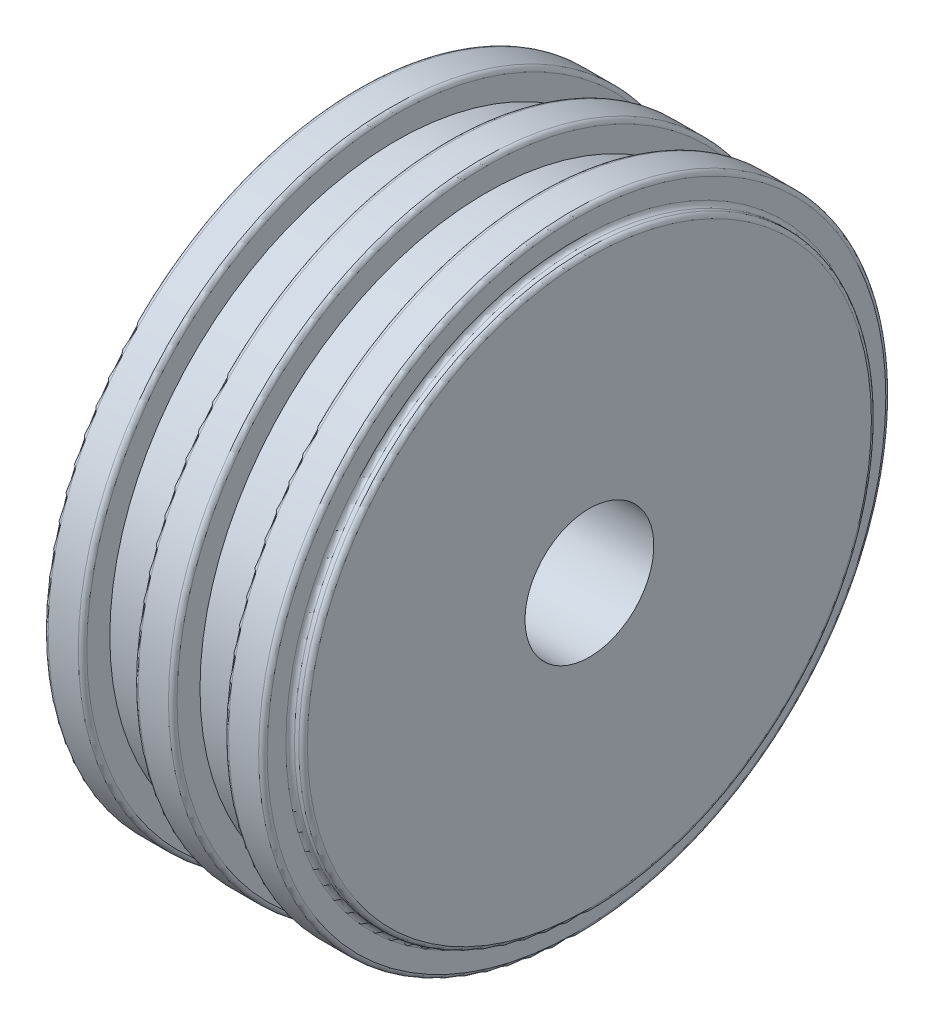
ISO-10303-21;
HEADER;
FILE_DESCRIPTION(('STEP AP214'),'2;1');
FILE_NAME('part.step','',(''),(''),'','','');
FILE_SCHEMA(('AUTOMOTIVE_DESIGN { 1 0 10303 214 1 1 1 1 }'));
ENDSEC;
DATA;
#1=APPLICATION_CONTEXT('core data for automotive mechanical design processes');
#2=APPLICATION_PROTOCOL_DEFINITION('international standard','automotive_design',2000,#1);
#3=PRODUCT_CONTEXT('',#1,'mechanical');
#4=PRODUCT('Part','Part','',(#3));
#5=PRODUCT_RELATED_PRODUCT_CATEGORY('part','',(#4));
#6=PRODUCT_DEFINITION_FORMATION('','',#4);
#7=PRODUCT_DEFINITION_CONTEXT('part definition',#1,'design');
#8=PRODUCT_DEFINITION('design','',#6,#7);
#9=PRODUCT_DEFINITION_SHAPE('','',#8);
#10=(LENGTH_UNIT() NAMED_UNIT(*) SI_UNIT(.MILLI.,.METRE.));
#11=(NAMED_UNIT(*) PLANE_ANGLE_UNIT() SI_UNIT($,.RADIAN.));
#12=(NAMED_UNIT(*) SI_UNIT($,.STERADIAN.) SOLID_ANGLE_UNIT());
#13=UNCERTAINTY_MEASURE_WITH_UNIT(LENGTH_MEASURE(1.E-05),#10,'distance_accuracy_value','');
#14=(GEOMETRIC_REPRESENTATION_CONTEXT(3) GLOBAL_UNCERTAINTY_ASSIGNED_CONTEXT((#13)) GLOBAL_UNIT_ASSIGNED_CONTEXT((#10,
#11,#12)) REPRESENTATION_CONTEXT('',''));
#15=CARTESIAN_POINT('',(0.,0.,0.));
#16=DIRECTION('',(0.,0.,1.));
#17=DIRECTION('',(1.,0.,0.));
#18=AXIS2_PLACEMENT_3D('',#15,#16,#17);
#19=CARTESIAN_POINT('',(-513.282786887971,0.,0.));
#20=DIRECTION('',(-1.,0.,0.));
#21=DIRECTION('',(0.,0.,1.));
#22=AXIS2_PLACEMENT_3D('',#19,#20,#21);
#23=CYLINDRICAL_SURFACE('',#22,15.);
#24=CARTESIAN_POINT('',(0.,0.,0.));
#25=DIRECTION('',(-1.,0.,0.));
#26=DIRECTION('',(0.,0.,1.));
#27=AXIS2_PLACEMENT_3D('',#24,#25,#26);
#28=CIRCLE('',#27,15.);
#29=CARTESIAN_POINT('',(0.,0.,15.));
#30=VERTEX_POINT('',#29);
#31=EDGE_CURVE('E105',#30,#30,#28,.T.);
#32=ORIENTED_EDGE('',*,*,#31,.F.);
#33=EDGE_LOOP('',(#32));
#34=FACE_BOUND('',#33,.T.);
#35=CARTESIAN_POINT('',(-57.,0.,0.));
#36=DIRECTION('',(-1.,0.,0.));
#37=DIRECTION('',(0.,0.,1.));
#38=AXIS2_PLACEMENT_3D('',#35,#36,#37);
#39=CIRCLE('',#38,15.);
#40=CARTESIAN_POINT('',(-57.,0.,15.));
#41=VERTEX_POINT('',#40);
#42=EDGE_CURVE('E120',#41,#41,#39,.T.);
#43=ORIENTED_EDGE('',*,*,#42,.T.);
#44=EDGE_LOOP('',(#43));
#45=FACE_BOUND('',#44,.T.);
#46=ADVANCED_FACE('F37',(#34,#45),#23,.F.);
#47=CARTESIAN_POINT('',(0.,15.,0.));
#48=DIRECTION('',(-1.,0.,0.));
#49=DIRECTION('',(0.,0.,1.));
#50=AXIS2_PLACEMENT_3D('',#47,#48,#49);
#51=PLANE('',#50);
#52=CARTESIAN_POINT('',(0.,0.,0.));
#53=DIRECTION('',(-1.,0.,0.));
#54=DIRECTION('',(0.,0.,1.));
#55=AXIS2_PLACEMENT_3D('',#52,#53,#54);
#56=CIRCLE('',#55,65.675);
#57=CARTESIAN_POINT('',(0.,0.,65.675));
#58=VERTEX_POINT('',#57);
#59=EDGE_CURVE('E10',#58,#58,#56,.F.);
#60=ORIENTED_EDGE('',*,*,#59,.T.);
#61=EDGE_LOOP('',(#60));
#62=FACE_BOUND('',#61,.T.);
#63=ORIENTED_EDGE('',*,*,#31,.T.);
#64=EDGE_LOOP('',(#63));
#65=FACE_BOUND('',#64,.T.);
#66=ADVANCED_FACE('F142',(#62,#65),#51,.F.);
#67=CARTESIAN_POINT('',(-513.282786887971,0.,0.));
#68=DIRECTION('',(-1.,0.,0.));
#69=DIRECTION('',(0.,0.,1.));
#70=AXIS2_PLACEMENT_3D('',#67,#68,#69);
#71=CYLINDRICAL_SURFACE('',#70,66.675);
#72=CARTESIAN_POINT('',(-1.,0.,0.));
#73=DIRECTION('',(-1.,0.,0.));
#74=DIRECTION('',(0.,0.,1.));
#75=AXIS2_PLACEMENT_3D('',#72,#73,#74);
#76=CIRCLE('',#75,66.675);
#77=CARTESIAN_POINT('',(-1.,0.,66.675));
#78=VERTEX_POINT('',#77);
#79=EDGE_CURVE('E44',#78,#78,#76,.T.);
#80=ORIENTED_EDGE('',*,*,#79,.T.);
#81=EDGE_LOOP('',(#80));
#82=FACE_BOUND('',#81,.T.);
#83=CARTESIAN_POINT('',(-2.,0.,0.));
#84=DIRECTION('',(-1.,0.,0.));
#85=DIRECTION('',(0.,0.,1.));
#86=AXIS2_PLACEMENT_3D('',#83,#84,#85);
#87=CIRCLE('',#86,66.675);
#88=CARTESIAN_POINT('',(-2.,0.,66.675));
#89=VERTEX_POINT('',#88);
#90=EDGE_CURVE('E48',#89,#89,#87,.F.);
#91=ORIENTED_EDGE('',*,*,#90,.T.);
#92=EDGE_LOOP('',(#91));
#93=FACE_BOUND('',#92,.T.);
#94=ADVANCED_FACE('F148',(#82,#93),#71,.T.);
#95=CARTESIAN_POINT('',(-3.,66.675,0.));
#96=DIRECTION('',(-1.,0.,0.));
#97=DIRECTION('',(0.,0.,1.));
#98=AXIS2_PLACEMENT_3D('',#95,#96,#97);
#99=PLANE('',#98);
#100=CARTESIAN_POINT('',(-3.,0.,0.));
#101=DIRECTION('',(-1.,0.,0.));
#102=DIRECTION('',(0.,0.,1.));
#103=AXIS2_PLACEMENT_3D('',#100,#101,#102);
#104=CIRCLE('',#103,72.025);
#105=CARTESIAN_POINT('',(-3.,0.,72.025));
#106=VERTEX_POINT('',#105);
#107=EDGE_CURVE('E93',#106,#106,#104,.F.);
#108=ORIENTED_EDGE('',*,*,#107,.T.);
#109=EDGE_LOOP('',(#108));
#110=FACE_BOUND('',#109,.T.);
#111=CARTESIAN_POINT('',(-3.,0.,0.));
#112=DIRECTION('',(-1.,0.,0.));
#113=DIRECTION('',(0.,0.,1.));
#114=AXIS2_PLACEMENT_3D('',#111,#112,#113);
#115=CIRCLE('',#114,67.675);
#116=CARTESIAN_POINT('',(-3.,0.,67.675));
#117=VERTEX_POINT('',#116);
#118=EDGE_CURVE('E96',#117,#117,#115,.T.);
#119=ORIENTED_EDGE('',*,*,#118,.T.);
#120=EDGE_LOOP('',(#119));
#121=FACE_BOUND('',#120,.T.);
#122=ADVANCED_FACE('F193',(#110,#121),#99,.F.);
#123=CARTESIAN_POINT('',(-513.282786887971,0.,0.));
#124=DIRECTION('',(-1.,0.,0.));
#125=DIRECTION('',(0.,0.,1.));
#126=AXIS2_PLACEMENT_3D('',#123,#124,#125);
#127=CYLINDRICAL_SURFACE('',#126,73.025);
#128=CARTESIAN_POINT('',(-4.,0.,0.));
#129=DIRECTION('',(-1.,0.,0.));
#130=DIRECTION('',(0.,0.,1.));
#131=AXIS2_PLACEMENT_3D('',#128,#129,#130);
#132=CIRCLE('',#131,73.025);
#133=CARTESIAN_POINT('',(-4.,0.,73.025));
#134=VERTEX_POINT('',#133);
#135=EDGE_CURVE('E99',#134,#134,#132,.T.);
#136=ORIENTED_EDGE('',*,*,#135,.T.);
#137=EDGE_LOOP('',(#136));
#138=FACE_BOUND('',#137,.T.);
#139=CARTESIAN_POINT('',(-11.,0.,0.));
#140=DIRECTION('',(1.,0.,0.));
#141=DIRECTION('',(0.,0.,-1.));
#142=AXIS2_PLACEMENT_3D('',#139,#140,#141);
#143=CIRCLE('',#142,73.025);
#144=CARTESIAN_POINT('',(-11.,0.,-73.025));
#145=VERTEX_POINT('',#144);
#146=EDGE_CURVE('E102',#145,#145,#143,.T.);
#147=ORIENTED_EDGE('',*,*,#146,.T.);
#148=EDGE_LOOP('',(#147));
#149=FACE_BOUND('',#148,.T.);
#150=ADVANCED_FACE('F195',(#138,#149),#127,.T.);
#151=CARTESIAN_POINT('',(-12.,73.025,0.));
#152=DIRECTION('',(1.,0.,0.));
#153=DIRECTION('',(0.,0.,-1.));
#154=AXIS2_PLACEMENT_3D('',#151,#152,#153);
#155=PLANE('',#154);
#156=CARTESIAN_POINT('',(-12.,0.,0.));
#157=DIRECTION('',(1.,0.,0.));
#158=DIRECTION('',(0.,0.,-1.));
#159=AXIS2_PLACEMENT_3D('',#156,#157,#158);
#160=CIRCLE('',#159,72.025);
#161=CARTESIAN_POINT('',(-12.,0.,-72.025));
#162=VERTEX_POINT('',#161);
#163=EDGE_CURVE('E90',#162,#162,#160,.F.);
#164=ORIENTED_EDGE('',*,*,#163,.T.);
#165=EDGE_LOOP('',(#164));
#166=FACE_BOUND('',#165,.T.);
#167=CARTESIAN_POINT('',(-12.,0.,0.));
#168=DIRECTION('',(-1.,0.,0.));
#169=DIRECTION('',(0.,0.,1.));
#170=AXIS2_PLACEMENT_3D('',#167,#168,#169);
#171=CIRCLE('',#170,66.675);
#172=CARTESIAN_POINT('',(-12.,0.,66.675));
#173=VERTEX_POINT('',#172);
#174=EDGE_CURVE('E108',#173,#173,#171,.T.);
#175=ORIENTED_EDGE('',*,*,#174,.F.);
#176=EDGE_LOOP('',(#175));
#177=FACE_BOUND('',#176,.T.);
#178=ADVANCED_FACE('F202',(#166,#177),#155,.F.);
#179=CARTESIAN_POINT('',(-513.282786887971,0.,0.));
#180=DIRECTION('',(-1.,0.,0.));
#181=DIRECTION('',(0.,0.,1.));
#182=AXIS2_PLACEMENT_3D('',#179,#180,#181);
#183=CYLINDRICAL_SURFACE('',#182,66.675);
#184=CARTESIAN_POINT('',(-24.,0.,0.));
#185=DIRECTION('',(-1.,0.,0.));
#186=DIRECTION('',(0.,0.,1.));
#187=AXIS2_PLACEMENT_3D('',#184,#185,#186);
#188=CIRCLE('',#187,66.675);
#189=CARTESIAN_POINT('',(-24.,0.,66.675));
#190=VERTEX_POINT('',#189);
#191=EDGE_CURVE('E111',#190,#190,#188,.T.);
#192=ORIENTED_EDGE('',*,*,#191,.F.);
#193=EDGE_LOOP('',(#192));
#194=FACE_BOUND('',#193,.T.);
#195=ORIENTED_EDGE('',*,*,#174,.T.);
#196=EDGE_LOOP('',(#195));
#197=FACE_BOUND('',#196,.T.);
#198=ADVANCED_FACE('F208',(#194,#197),#183,.T.);
#199=CARTESIAN_POINT('',(-24.,66.675,0.));
#200=DIRECTION('',(-1.,0.,0.));
#201=DIRECTION('',(0.,0.,1.));
#202=AXIS2_PLACEMENT_3D('',#199,#200,#201);
#203=PLANE('',#202);
#204=CARTESIAN_POINT('',(-24.,0.,0.));
#205=DIRECTION('',(-1.,0.,0.));
#206=DIRECTION('',(0.,0.,1.));
#207=AXIS2_PLACEMENT_3D('',#204,#205,#206);
#208=CIRCLE('',#207,72.025);
#209=CARTESIAN_POINT('',(-24.,0.,72.025));
#210=VERTEX_POINT('',#209);
#211=EDGE_CURVE('E81',#210,#210,#208,.F.);
#212=ORIENTED_EDGE('',*,*,#211,.T.);
#213=EDGE_LOOP('',(#212));
#214=FACE_BOUND('',#213,.T.);
#215=ORIENTED_EDGE('',*,*,#191,.T.);
#216=EDGE_LOOP('',(#215));
#217=FACE_BOUND('',#216,.T.);
#218=ADVANCED_FACE('F212',(#214,#217),#203,.F.);
#219=CARTESIAN_POINT('',(-513.282786887971,0.,0.));
#220=DIRECTION('',(-1.,0.,0.));
#221=DIRECTION('',(0.,0.,1.));
#222=AXIS2_PLACEMENT_3D('',#219,#220,#221);
#223=CYLINDRICAL_SURFACE('',#222,73.025);
#224=CARTESIAN_POINT('',(-25.,0.,0.));
#225=DIRECTION('',(-1.,0.,0.));
#226=DIRECTION('',(0.,0.,1.));
#227=AXIS2_PLACEMENT_3D('',#224,#225,#226);
#228=CIRCLE('',#227,73.025);
#229=CARTESIAN_POINT('',(-25.,0.,73.025));
#230=VERTEX_POINT('',#229);
#231=EDGE_CURVE('E84',#230,#230,#228,.T.);
#232=ORIENTED_EDGE('',*,*,#231,.T.);
#233=EDGE_LOOP('',(#232));
#234=FACE_BOUND('',#233,.T.);
#235=CARTESIAN_POINT('',(-32.,0.,0.));
#236=DIRECTION('',(1.,0.,0.));
#237=DIRECTION('',(0.,0.,-1.));
#238=AXIS2_PLACEMENT_3D('',#235,#236,#237);
#239=CIRCLE('',#238,73.025);
#240=CARTESIAN_POINT('',(-32.,0.,-73.025));
#241=VERTEX_POINT('',#240);
#242=EDGE_CURVE('E87',#241,#241,#239,.T.);
#243=ORIENTED_EDGE('',*,*,#242,.T.);
#244=EDGE_LOOP('',(#243));
#245=FACE_BOUND('',#244,.T.);
#246=ADVANCED_FACE('F216',(#234,#245),#223,.T.);
#247=CARTESIAN_POINT('',(-33.,73.025,0.));
#248=DIRECTION('',(1.,0.,0.));
#249=DIRECTION('',(0.,0.,-1.));
#250=AXIS2_PLACEMENT_3D('',#247,#248,#249);
#251=PLANE('',#250);
#252=CARTESIAN_POINT('',(-33.,0.,0.));
#253=DIRECTION('',(1.,0.,0.));
#254=DIRECTION('',(0.,0.,-1.));
#255=AXIS2_PLACEMENT_3D('',#252,#253,#254);
#256=CIRCLE('',#255,72.025);
#257=CARTESIAN_POINT('',(-33.,0.,-72.025));
#258=VERTEX_POINT('',#257);
#259=EDGE_CURVE('E78',#258,#258,#256,.F.);
#260=ORIENTED_EDGE('',*,*,#259,.T.);
#261=EDGE_LOOP('',(#260));
#262=FACE_BOUND('',#261,.T.);
#263=CARTESIAN_POINT('',(-33.,0.,0.));
#264=DIRECTION('',(-1.,0.,0.));
#265=DIRECTION('',(0.,0.,1.));
#266=AXIS2_PLACEMENT_3D('',#263,#264,#265);
#267=CIRCLE('',#266,66.675);
#268=CARTESIAN_POINT('',(-33.,0.,66.675));
#269=VERTEX_POINT('',#268);
#270=EDGE_CURVE('E114',#269,#269,#267,.T.);
#271=ORIENTED_EDGE('',*,*,#270,.F.);
#272=EDGE_LOOP('',(#271));
#273=FACE_BOUND('',#272,.T.);
#274=ADVANCED_FACE('F220',(#262,#273),#251,.F.);
#275=CARTESIAN_POINT('',(-513.282786887971,0.,0.));
#276=DIRECTION('',(-1.,0.,0.));
#277=DIRECTION('',(0.,0.,1.));
#278=AXIS2_PLACEMENT_3D('',#275,#276,#277);
#279=CYLINDRICAL_SURFACE('',#278,66.675);
#280=CARTESIAN_POINT('',(-45.,0.,0.));
#281=DIRECTION('',(-1.,0.,0.));
#282=DIRECTION('',(0.,0.,1.));
#283=AXIS2_PLACEMENT_3D('',#280,#281,#282);
#284=CIRCLE('',#283,66.675);
#285=CARTESIAN_POINT('',(-45.,0.,66.675));
#286=VERTEX_POINT('',#285);
#287=EDGE_CURVE('E117',#286,#286,#284,.T.);
#288=ORIENTED_EDGE('',*,*,#287,.F.);
#289=EDGE_LOOP('',(#288));
#290=FACE_BOUND('',#289,.T.);
#291=ORIENTED_EDGE('',*,*,#270,.T.);
#292=EDGE_LOOP('',(#291));
#293=FACE_BOUND('',#292,.T.);
#294=ADVANCED_FACE('F224',(#290,#293),#279,.T.);
#295=CARTESIAN_POINT('',(-45.,66.675,0.));
#296=DIRECTION('',(-1.,0.,0.));
#297=DIRECTION('',(0.,0.,1.));
#298=AXIS2_PLACEMENT_3D('',#295,#296,#297);
#299=PLANE('',#298);
#300=CARTESIAN_POINT('',(-45.,0.,0.));
#301=DIRECTION('',(-1.,0.,0.));
#302=DIRECTION('',(0.,0.,1.));
#303=AXIS2_PLACEMENT_3D('',#300,#301,#302);
#304=CIRCLE('',#303,72.025);
#305=CARTESIAN_POINT('',(-45.,0.,72.025));
#306=VERTEX_POINT('',#305);
#307=EDGE_CURVE('E69',#306,#306,#304,.F.);
#308=ORIENTED_EDGE('',*,*,#307,.T.);
#309=EDGE_LOOP('',(#308));
#310=FACE_BOUND('',#309,.T.);
#311=ORIENTED_EDGE('',*,*,#287,.T.);
#312=EDGE_LOOP('',(#311));
#313=FACE_BOUND('',#312,.T.);
#314=ADVANCED_FACE('F228',(#310,#313),#299,.F.);
#315=CARTESIAN_POINT('',(-513.282786887971,0.,0.));
#316=DIRECTION('',(-1.,0.,0.));
#317=DIRECTION('',(0.,0.,1.));
#318=AXIS2_PLACEMENT_3D('',#315,#316,#317);
#319=CYLINDRICAL_SURFACE('',#318,73.025);
#320=CARTESIAN_POINT('',(-46.,0.,0.));
#321=DIRECTION('',(-1.,0.,0.));
#322=DIRECTION('',(0.,0.,1.));
#323=AXIS2_PLACEMENT_3D('',#320,#321,#322);
#324=CIRCLE('',#323,73.025);
#325=CARTESIAN_POINT('',(-46.,0.,73.025));
#326=VERTEX_POINT('',#325);
#327=EDGE_CURVE('E72',#326,#326,#324,.T.);
#328=ORIENTED_EDGE('',*,*,#327,.T.);
#329=EDGE_LOOP('',(#328));
#330=FACE_BOUND('',#329,.T.);
#331=CARTESIAN_POINT('',(-53.,0.,0.));
#332=DIRECTION('',(1.,0.,0.));
#333=DIRECTION('',(0.,0.,-1.));
#334=AXIS2_PLACEMENT_3D('',#331,#332,#333);
#335=CIRCLE('',#334,73.025);
#336=CARTESIAN_POINT('',(-53.,0.,-73.025));
#337=VERTEX_POINT('',#336);
#338=EDGE_CURVE('E75',#337,#337,#335,.T.);
#339=ORIENTED_EDGE('',*,*,#338,.T.);
#340=EDGE_LOOP('',(#339));
#341=FACE_BOUND('',#340,.T.);
#342=ADVANCED_FACE('F232',(#330,#341),#319,.T.);
#343=CARTESIAN_POINT('',(-54.,73.025,0.));
#344=DIRECTION('',(1.,0.,0.));
#345=DIRECTION('',(0.,0.,-1.));
#346=AXIS2_PLACEMENT_3D('',#343,#344,#345);
#347=PLANE('',#346);
#348=CARTESIAN_POINT('',(-54.,0.,0.));
#349=DIRECTION('',(1.,0.,0.));
#350=DIRECTION('',(0.,0.,-1.));
#351=AXIS2_PLACEMENT_3D('',#348,#349,#350);
#352=CIRCLE('',#351,72.025);
#353=CARTESIAN_POINT('',(-54.,0.,-72.025));
#354=VERTEX_POINT('',#353);
#355=EDGE_CURVE('E63',#354,#354,#352,.F.);
#356=ORIENTED_EDGE('',*,*,#355,.T.);
#357=EDGE_LOOP('',(#356));
#358=FACE_BOUND('',#357,.T.);
#359=CARTESIAN_POINT('',(-54.,0.,0.));
#360=DIRECTION('',(1.,0.,0.));
#361=DIRECTION('',(0.,0.,-1.));
#362=AXIS2_PLACEMENT_3D('',#359,#360,#361);
#363=CIRCLE('',#362,67.675);
#364=CARTESIAN_POINT('',(-54.,0.,-67.675));
#365=VERTEX_POINT('',#364);
#366=EDGE_CURVE('E66',#365,#365,#363,.T.);
#367=ORIENTED_EDGE('',*,*,#366,.T.);
#368=EDGE_LOOP('',(#367));
#369=FACE_BOUND('',#368,.T.);
#370=ADVANCED_FACE('F138',(#358,#369),#347,.F.);
#371=CARTESIAN_POINT('',(-513.282786887971,0.,0.));
#372=DIRECTION('',(-1.,0.,0.));
#373=DIRECTION('',(0.,0.,1.));
#374=AXIS2_PLACEMENT_3D('',#371,#372,#373);
#375=CYLINDRICAL_SURFACE('',#374,66.675);
#376=CARTESIAN_POINT('',(-55.,0.,0.));
#377=DIRECTION('',(1.,0.,0.));
#378=DIRECTION('',(0.,0.,-1.));
#379=AXIS2_PLACEMENT_3D('',#376,#377,#378);
#380=CIRCLE('',#379,66.675);
#381=CARTESIAN_POINT('',(-55.,0.,-66.675));
#382=VERTEX_POINT('',#381);
#383=EDGE_CURVE('E57',#382,#382,#380,.F.);
#384=ORIENTED_EDGE('',*,*,#383,.T.);
#385=EDGE_LOOP('',(#384));
#386=FACE_BOUND('',#385,.T.);
#387=CARTESIAN_POINT('',(-56.,0.,0.));
#388=DIRECTION('',(1.,0.,0.));
#389=DIRECTION('',(0.,0.,-1.));
#390=AXIS2_PLACEMENT_3D('',#387,#388,#389);
#391=CIRCLE('',#390,66.675);
#392=CARTESIAN_POINT('',(-56.,0.,-66.675));
#393=VERTEX_POINT('',#392);
#394=EDGE_CURVE('E60',#393,#393,#391,.T.);
#395=ORIENTED_EDGE('',*,*,#394,.T.);
#396=EDGE_LOOP('',(#395));
#397=FACE_BOUND('',#396,.T.);
#398=ADVANCED_FACE('F128',(#386,#397),#375,.T.);
#399=CARTESIAN_POINT('',(-57.,66.675,0.));
#400=DIRECTION('',(1.,0.,0.));
#401=DIRECTION('',(0.,0.,-1.));
#402=AXIS2_PLACEMENT_3D('',#399,#400,#401);
#403=PLANE('',#402);
#404=CARTESIAN_POINT('',(-57.,0.,0.));
#405=DIRECTION('',(1.,0.,0.));
#406=DIRECTION('',(0.,0.,-1.));
#407=AXIS2_PLACEMENT_3D('',#404,#405,#406);
#408=CIRCLE('',#407,65.675);
#409=CARTESIAN_POINT('',(-57.,0.,-65.675));
#410=VERTEX_POINT('',#409);
#411=EDGE_CURVE('E52',#410,#410,#408,.F.);
#412=ORIENTED_EDGE('',*,*,#411,.T.);
#413=EDGE_LOOP('',(#412));
#414=FACE_BOUND('',#413,.T.);
#415=ORIENTED_EDGE('',*,*,#42,.F.);
#416=EDGE_LOOP('',(#415));
#417=FACE_BOUND('',#416,.T.);
#418=ADVANCED_FACE('F125',(#414,#417),#403,.F.);
#419=CARTESIAN_POINT('',(-4.,0.,0.));
#420=DIRECTION('',(-1.,0.,0.));
#421=DIRECTION('',(0.,0.,1.));
#422=AXIS2_PLACEMENT_3D('',#419,#420,#421);
#423=TOROIDAL_SURFACE('',#422,72.025,1.);
#424=ORIENTED_EDGE('',*,*,#107,.F.);
#425=EDGE_LOOP('',(#424));
#426=FACE_BOUND('',#425,.T.);
#427=ORIENTED_EDGE('',*,*,#135,.F.);
#428=EDGE_LOOP('',(#427));
#429=FACE_BOUND('',#428,.T.);
#430=ADVANCED_FACE('F127',(#426,#429),#423,.T.);
#431=CARTESIAN_POINT('',(-11.,0.,0.));
#432=DIRECTION('',(1.,0.,0.));
#433=DIRECTION('',(0.,0.,-1.));
#434=AXIS2_PLACEMENT_3D('',#431,#432,#433);
#435=TOROIDAL_SURFACE('',#434,72.025,1.);
#436=ORIENTED_EDGE('',*,*,#146,.F.);
#437=EDGE_LOOP('',(#436));
#438=FACE_BOUND('',#437,.T.);
#439=ORIENTED_EDGE('',*,*,#163,.F.);
#440=EDGE_LOOP('',(#439));
#441=FACE_BOUND('',#440,.T.);
#442=ADVANCED_FACE('F135',(#438,#441),#435,.T.);
#443=CARTESIAN_POINT('',(-25.,0.,0.));
#444=DIRECTION('',(-1.,0.,0.));
#445=DIRECTION('',(0.,0.,1.));
#446=AXIS2_PLACEMENT_3D('',#443,#444,#445);
#447=TOROIDAL_SURFACE('',#446,72.025,1.);
#448=ORIENTED_EDGE('',*,*,#211,.F.);
#449=EDGE_LOOP('',(#448));
#450=FACE_BOUND('',#449,.T.);
#451=ORIENTED_EDGE('',*,*,#231,.F.);
#452=EDGE_LOOP('',(#451));
#453=FACE_BOUND('',#452,.T.);
#454=ADVANCED_FACE('F155',(#450,#453),#447,.T.);
#455=CARTESIAN_POINT('',(-32.,0.,0.));
#456=DIRECTION('',(1.,0.,0.));
#457=DIRECTION('',(0.,0.,-1.));
#458=AXIS2_PLACEMENT_3D('',#455,#456,#457);
#459=TOROIDAL_SURFACE('',#458,72.025,1.);
#460=ORIENTED_EDGE('',*,*,#242,.F.);
#461=EDGE_LOOP('',(#460));
#462=FACE_BOUND('',#461,.T.);
#463=ORIENTED_EDGE('',*,*,#259,.F.);
#464=EDGE_LOOP('',(#463));
#465=FACE_BOUND('',#464,.T.);
#466=ADVANCED_FACE('F159',(#462,#465),#459,.T.);
#467=CARTESIAN_POINT('',(-46.,0.,0.));
#468=DIRECTION('',(-1.,0.,0.));
#469=DIRECTION('',(0.,0.,1.));
#470=AXIS2_PLACEMENT_3D('',#467,#468,#469);
#471=TOROIDAL_SURFACE('',#470,72.025,1.);
#472=ORIENTED_EDGE('',*,*,#307,.F.);
#473=EDGE_LOOP('',(#472));
#474=FACE_BOUND('',#473,.T.);
#475=ORIENTED_EDGE('',*,*,#327,.F.);
#476=EDGE_LOOP('',(#475));
#477=FACE_BOUND('',#476,.T.);
#478=ADVANCED_FACE('F163',(#474,#477),#471,.T.);
#479=CARTESIAN_POINT('',(-53.,0.,0.));
#480=DIRECTION('',(1.,0.,0.));
#481=DIRECTION('',(0.,0.,-1.));
#482=AXIS2_PLACEMENT_3D('',#479,#480,#481);
#483=TOROIDAL_SURFACE('',#482,72.025,1.);
#484=ORIENTED_EDGE('',*,*,#338,.F.);
#485=EDGE_LOOP('',(#484));
#486=FACE_BOUND('',#485,.T.);
#487=ORIENTED_EDGE('',*,*,#355,.F.);
#488=EDGE_LOOP('',(#487));
#489=FACE_BOUND('',#488,.T.);
#490=ADVANCED_FACE('F167',(#486,#489),#483,.T.);
#491=CARTESIAN_POINT('',(-55.,0.,0.));
#492=DIRECTION('',(1.,0.,0.));
#493=DIRECTION('',(0.,0.,-1.));
#494=AXIS2_PLACEMENT_3D('',#491,#492,#493);
#495=TOROIDAL_SURFACE('',#494,67.675,1.);
#496=ORIENTED_EDGE('',*,*,#366,.F.);
#497=EDGE_LOOP('',(#496));
#498=FACE_BOUND('',#497,.T.);
#499=ORIENTED_EDGE('',*,*,#383,.F.);
#500=EDGE_LOOP('',(#499));
#501=FACE_BOUND('',#500,.T.);
#502=ADVANCED_FACE('F171',(#498,#501),#495,.F.);
#503=CARTESIAN_POINT('',(-56.,0.,0.));
#504=DIRECTION('',(1.,0.,0.));
#505=DIRECTION('',(0.,0.,-1.));
#506=AXIS2_PLACEMENT_3D('',#503,#504,#505);
#507=TOROIDAL_SURFACE('',#506,65.675,1.);
#508=ORIENTED_EDGE('',*,*,#394,.F.);
#509=EDGE_LOOP('',(#508));
#510=FACE_BOUND('',#509,.T.);
#511=ORIENTED_EDGE('',*,*,#411,.F.);
#512=EDGE_LOOP('',(#511));
#513=FACE_BOUND('',#512,.T.);
#514=ADVANCED_FACE('F175',(#510,#513),#507,.T.);
#515=CARTESIAN_POINT('',(-1.,0.,0.));
#516=DIRECTION('',(-1.,0.,0.));
#517=DIRECTION('',(0.,0.,1.));
#518=AXIS2_PLACEMENT_3D('',#515,#516,#517);
#519=TOROIDAL_SURFACE('',#518,65.675,1.);
#520=ORIENTED_EDGE('',*,*,#59,.F.);
#521=EDGE_LOOP('',(#520));
#522=FACE_BOUND('',#521,.T.);
#523=ORIENTED_EDGE('',*,*,#79,.F.);
#524=EDGE_LOOP('',(#523));
#525=FACE_BOUND('',#524,.T.);
#526=ADVANCED_FACE('F178',(#522,#525),#519,.T.);
#527=CARTESIAN_POINT('',(-2.,0.,0.));
#528=DIRECTION('',(-1.,0.,0.));
#529=DIRECTION('',(0.,0.,1.));
#530=AXIS2_PLACEMENT_3D('',#527,#528,#529);
#531=TOROIDAL_SURFACE('',#530,67.675,1.);
#532=ORIENTED_EDGE('',*,*,#90,.F.);
#533=EDGE_LOOP('',(#532));
#534=FACE_BOUND('',#533,.T.);
#535=ORIENTED_EDGE('',*,*,#118,.F.);
#536=EDGE_LOOP('',(#535));
#537=FACE_BOUND('',#536,.T.);
#538=ADVANCED_FACE('F39',(#534,#537),#531,.F.);
#539=CLOSED_SHELL('',(#46,#66,#94,#122,#150,#178,#198,#218,#246,#274,#294,#314,#342,#370,#398,
#418,#430,#442,#454,#466,#478,#490,#502,#514,#526,#538));
#540=MANIFOLD_SOLID_BREP('B2',#539);
#541=ADVANCED_BREP_SHAPE_REPRESENTATION('',(#18,#540),#14);
#542=SHAPE_DEFINITION_REPRESENTATION(#9,#541);
ENDSEC;
END-ISO-10303-21;
